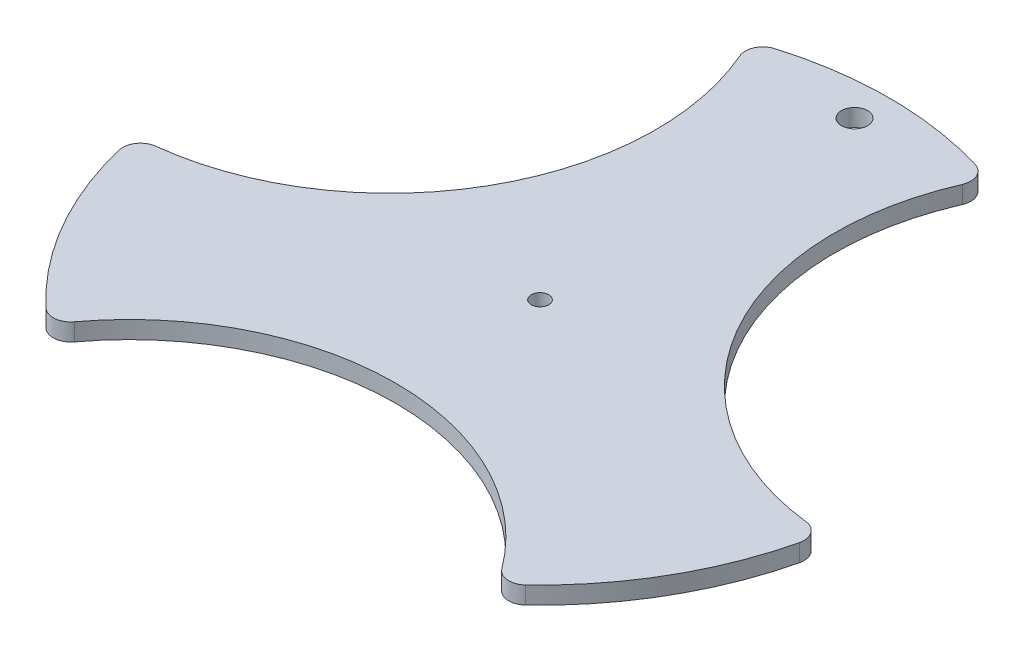
ISO-10303-21;
HEADER;
FILE_DESCRIPTION(('STEP AP214'),'2;1');
FILE_NAME('part.step','',(''),(''),'','','');
FILE_SCHEMA(('AUTOMOTIVE_DESIGN { 1 0 10303 214 1 1 1 1 }'));
ENDSEC;
DATA;
#1=APPLICATION_CONTEXT('core data for automotive mechanical design processes');
#2=APPLICATION_PROTOCOL_DEFINITION('international standard','automotive_design',2000,#1);
#3=PRODUCT_CONTEXT('',#1,'mechanical');
#4=PRODUCT('Part','Part','',(#3));
#5=PRODUCT_RELATED_PRODUCT_CATEGORY('part','',(#4));
#6=PRODUCT_DEFINITION_FORMATION('','',#4);
#7=PRODUCT_DEFINITION_CONTEXT('part definition',#1,'design');
#8=PRODUCT_DEFINITION('design','',#6,#7);
#9=PRODUCT_DEFINITION_SHAPE('','',#8);
#10=(LENGTH_UNIT() NAMED_UNIT(*) SI_UNIT(.MILLI.,.METRE.));
#11=(NAMED_UNIT(*) PLANE_ANGLE_UNIT() SI_UNIT($,.RADIAN.));
#12=(NAMED_UNIT(*) SI_UNIT($,.STERADIAN.) SOLID_ANGLE_UNIT());
#13=UNCERTAINTY_MEASURE_WITH_UNIT(LENGTH_MEASURE(1.E-05),#10,'distance_accuracy_value','');
#14=(GEOMETRIC_REPRESENTATION_CONTEXT(3) GLOBAL_UNCERTAINTY_ASSIGNED_CONTEXT((#13)) GLOBAL_UNIT_ASSIGNED_CONTEXT((#10,
#11,#12)) REPRESENTATION_CONTEXT('',''));
#15=CARTESIAN_POINT('',(0.,0.,0.));
#16=DIRECTION('',(0.,0.,1.));
#17=DIRECTION('',(1.,0.,0.));
#18=AXIS2_PLACEMENT_3D('',#15,#16,#17);
#19=CARTESIAN_POINT('',(0.,2.,0.));
#20=DIRECTION('',(0.,-1.,0.));
#21=DIRECTION('',(0.,0.,-1.));
#22=AXIS2_PLACEMENT_3D('',#19,#20,#21);
#23=CYLINDRICAL_SURFACE('',#22,40.);
#24=CARTESIAN_POINT('',(0.,2.,0.));
#25=DIRECTION('',(0.,1.,0.));
#26=DIRECTION('',(0.,0.,1.));
#27=AXIS2_PLACEMENT_3D('',#24,#25,#26);
#28=CIRCLE('',#27,40.);
#29=CARTESIAN_POINT('',(-38.9226653628251,2.,9.22096096150172));
#30=VERTEX_POINT('',#29);
#31=CARTESIAN_POINT('',(-27.4469191213783,2.,29.0975365064556));
#32=VERTEX_POINT('',#31);
#33=EDGE_CURVE('E156',#30,#32,#28,.T.);
#34=ORIENTED_EDGE('',*,*,#33,.F.);
#35=DIRECTION('',(0.,-1.,0.));
#36=VECTOR('',#35,1.);
#37=CARTESIAN_POINT('',(-38.9226653628251,2.,9.22096096150172));
#38=LINE('',#37,#36);
#39=CARTESIAN_POINT('',(-38.9226653628251,0.,9.22096096150172));
#40=VERTEX_POINT('',#39);
#41=EDGE_CURVE('E211',#30,#40,#38,.T.);
#42=ORIENTED_EDGE('',*,*,#41,.T.);
#43=CARTESIAN_POINT('',(0.,0.,0.));
#44=DIRECTION('',(0.,1.,0.));
#45=DIRECTION('',(0.,0.,1.));
#46=AXIS2_PLACEMENT_3D('',#43,#44,#45);
#47=CIRCLE('',#46,40.);
#48=CARTESIAN_POINT('',(-27.4469191213783,0.,29.0975365064556));
#49=VERTEX_POINT('',#48);
#50=EDGE_CURVE('E152',#40,#49,#47,.T.);
#51=ORIENTED_EDGE('',*,*,#50,.T.);
#52=DIRECTION('',(0.,-1.,0.));
#53=VECTOR('',#52,1.);
#54=CARTESIAN_POINT('',(-27.4469191213783,2.,29.0975365064556));
#55=LINE('',#54,#53);
#56=EDGE_CURVE('E208',#49,#32,#55,.F.);
#57=ORIENTED_EDGE('',*,*,#56,.T.);
#58=EDGE_LOOP('',(#34,#42,#51,#57));
#59=FACE_BOUND('',#58,.T.);
#60=ADVANCED_FACE('F39',(#59),#23,.T.);
#61=CARTESIAN_POINT('',(11.4757462414471,0.,-38.3184974679581));
#62=VERTEX_POINT('',#61);
#63=CARTESIAN_POINT('',(-11.4757462414463,0.,-38.3184974679583));
#64=VERTEX_POINT('',#63);
#65=EDGE_CURVE('E142',#62,#64,#47,.T.);
#66=ORIENTED_EDGE('',*,*,#65,.T.);
#67=DIRECTION('',(0.,-1.,0.));
#68=VECTOR('',#67,1.);
#69=CARTESIAN_POINT('',(-11.4757462414463,2.,-38.3184974679583));
#70=LINE('',#69,#68);
#71=CARTESIAN_POINT('',(-11.4757462414463,2.,-38.3184974679583));
#72=VERTEX_POINT('',#71);
#73=EDGE_CURVE('E146',#64,#72,#70,.F.);
#74=ORIENTED_EDGE('',*,*,#73,.T.);
#75=CARTESIAN_POINT('',(11.4757462414471,2.,-38.3184974679581));
#76=VERTEX_POINT('',#75);
#77=EDGE_CURVE('E145',#76,#72,#28,.T.);
#78=ORIENTED_EDGE('',*,*,#77,.F.);
#79=DIRECTION('',(0.,-1.,0.));
#80=VECTOR('',#79,1.);
#81=CARTESIAN_POINT('',(11.4757462414471,2.,-38.3184974679581));
#82=LINE('',#81,#80);
#83=EDGE_CURVE('E132',#76,#62,#82,.T.);
#84=ORIENTED_EDGE('',*,*,#83,.T.);
#85=EDGE_LOOP('',(#66,#74,#78,#84));
#86=FACE_BOUND('',#85,.T.);
#87=ADVANCED_FACE('F140',(#86),#23,.T.);
#88=CARTESIAN_POINT('',(27.4469191213777,2.,29.0975365064562));
#89=VERTEX_POINT('',#88);
#90=CARTESIAN_POINT('',(38.9226653628249,2.,9.22096096150251));
#91=VERTEX_POINT('',#90);
#92=EDGE_CURVE('E151',#89,#91,#28,.T.);
#93=ORIENTED_EDGE('',*,*,#92,.F.);
#94=DIRECTION('',(0.,-1.,0.));
#95=VECTOR('',#94,1.);
#96=CARTESIAN_POINT('',(27.4469191213777,2.,29.0975365064562));
#97=LINE('',#96,#95);
#98=CARTESIAN_POINT('',(27.4469191213777,0.,29.0975365064562));
#99=VERTEX_POINT('',#98);
#100=EDGE_CURVE('E11',#89,#99,#97,.T.);
#101=ORIENTED_EDGE('',*,*,#100,.T.);
#102=CARTESIAN_POINT('',(38.9226653628249,0.,9.22096096150251));
#103=VERTEX_POINT('',#102);
#104=EDGE_CURVE('E154',#99,#103,#47,.T.);
#105=ORIENTED_EDGE('',*,*,#104,.T.);
#106=DIRECTION('',(0.,-1.,0.));
#107=VECTOR('',#106,1.);
#108=CARTESIAN_POINT('',(38.9226653628249,2.,9.22096096150251));
#109=LINE('',#108,#107);
#110=EDGE_CURVE('E47',#103,#91,#109,.F.);
#111=ORIENTED_EDGE('',*,*,#110,.T.);
#112=EDGE_LOOP('',(#93,#101,#105,#111));
#113=FACE_BOUND('',#112,.T.);
#114=ADVANCED_FACE('F218',(#113),#23,.T.);
#115=CARTESIAN_POINT('',(0.,2.,0.));
#116=DIRECTION('',(0.,1.,0.));
#117=DIRECTION('',(0.,0.,1.));
#118=AXIS2_PLACEMENT_3D('',#115,#116,#117);
#119=PLANE('',#118);
#120=ORIENTED_EDGE('',*,*,#77,.T.);
#121=CARTESIAN_POINT('',(-10.901958929374,2.,-36.4025725945604));
#122=DIRECTION('',(0.,1.,0.));
#123=DIRECTION('',(0.,0.,1.));
#124=AXIS2_PLACEMENT_3D('',#121,#122,#123);
#125=CIRCLE('',#124,2.);
#126=CARTESIAN_POINT('',(-12.7372189954233,2.,-35.6077012276307));
#127=VERTEX_POINT('',#126);
#128=EDGE_CURVE('E182',#72,#127,#125,.T.);
#129=ORIENTED_EDGE('',*,*,#128,.T.);
#130=CARTESIAN_POINT('',(-40.6985714944967,2.,-23.4973312079817));
#131=DIRECTION('',(0.,1.,0.));
#132=DIRECTION('',(0.866025403784443,0.,-0.499999999999992));
#133=AXIS2_PLACEMENT_3D('',#130,#131,#132);
#134=CIRCLE('',#133,30.4712700029102);
#135=CARTESIAN_POINT('',(-37.2057833312064,2.,6.77309539021196));
#136=VERTEX_POINT('',#135);
#137=EDGE_CURVE('E241',#136,#127,#134,.T.);
#138=ORIENTED_EDGE('',*,*,#137,.F.);
#139=CARTESIAN_POINT('',(-36.9765320946838,2.,8.75991291342663));
#140=DIRECTION('',(0.,1.,0.));
#141=DIRECTION('',(0.,0.,1.));
#142=AXIS2_PLACEMENT_3D('',#139,#140,#141);
#143=CIRCLE('',#142,2.);
#144=EDGE_CURVE('E187',#136,#30,#143,.T.);
#145=ORIENTED_EDGE('',*,*,#144,.T.);
#146=ORIENTED_EDGE('',*,*,#33,.T.);
#147=CARTESIAN_POINT('',(-26.0745731653094,2.,27.6426596811328));
#148=DIRECTION('',(0.,1.,0.));
#149=DIRECTION('',(0.,0.,1.));
#150=AXIS2_PLACEMENT_3D('',#147,#148,#149);
#151=CIRCLE('',#150,2.);
#152=CARTESIAN_POINT('',(-24.4685643357827,2.,28.8346058374177));
#153=VERTEX_POINT('',#152);
#154=EDGE_CURVE('E191',#32,#153,#151,.T.);
#155=ORIENTED_EDGE('',*,*,#154,.T.);
#156=CARTESIAN_POINT('',(-4.85722573273506E-13,2.,46.9946624159623));
#157=DIRECTION('',(0.,1.,0.));
#158=DIRECTION('',(-0.866025403784436,0.,-0.500000000000004));
#159=AXIS2_PLACEMENT_3D('',#156,#157,#158);
#160=CIRCLE('',#159,30.4712700029102);
#161=CARTESIAN_POINT('',(24.4685643357822,2.,28.8346058374183));
#162=VERTEX_POINT('',#161);
#163=EDGE_CURVE('E227',#162,#153,#160,.T.);
#164=ORIENTED_EDGE('',*,*,#163,.F.);
#165=CARTESIAN_POINT('',(26.0745731653088,2.,27.6426596811334));
#166=DIRECTION('',(0.,1.,0.));
#167=DIRECTION('',(0.,0.,1.));
#168=AXIS2_PLACEMENT_3D('',#165,#166,#167);
#169=CIRCLE('',#168,2.);
#170=EDGE_CURVE('E225',#162,#89,#169,.T.);
#171=ORIENTED_EDGE('',*,*,#170,.T.);
#172=ORIENTED_EDGE('',*,*,#92,.T.);
#173=CARTESIAN_POINT('',(36.9765320946836,2.,8.75991291342739));
#174=DIRECTION('',(0.,1.,0.));
#175=DIRECTION('',(0.,0.,1.));
#176=AXIS2_PLACEMENT_3D('',#173,#174,#175);
#177=CIRCLE('',#176,2.);
#178=CARTESIAN_POINT('',(37.2057833312062,2.,6.77309539021273));
#179=VERTEX_POINT('',#178);
#180=EDGE_CURVE('E222',#91,#179,#177,.T.);
#181=ORIENTED_EDGE('',*,*,#180,.T.);
#182=CARTESIAN_POINT('',(40.6985714944972,2.,-23.4973312079809));
#183=DIRECTION('',(0.,1.,0.));
#184=DIRECTION('',(0.,0.,1.));
#185=AXIS2_PLACEMENT_3D('',#182,#183,#184);
#186=CIRCLE('',#185,30.4712700029102);
#187=CARTESIAN_POINT('',(12.737218995424,2.,-35.6077012276304));
#188=VERTEX_POINT('',#187);
#189=EDGE_CURVE('E186',#188,#179,#186,.T.);
#190=ORIENTED_EDGE('',*,*,#189,.F.);
#191=CARTESIAN_POINT('',(10.9019589293747,2.,-36.4025725945602));
#192=DIRECTION('',(0.,1.,0.));
#193=DIRECTION('',(0.,0.,1.));
#194=AXIS2_PLACEMENT_3D('',#191,#192,#193);
#195=CIRCLE('',#194,2.);
#196=EDGE_CURVE('E185',#188,#76,#195,.T.);
#197=ORIENTED_EDGE('',*,*,#196,.T.);
#198=EDGE_LOOP('',(#120,#129,#138,#145,#146,#155,#164,#171,#172,#181,#190,#197));
#199=FACE_BOUND('',#198,.T.);
#200=CARTESIAN_POINT('',(0.,2.,0.));
#201=DIRECTION('',(0.,1.,0.));
#202=DIRECTION('',(0.,0.,1.));
#203=AXIS2_PLACEMENT_3D('',#200,#201,#202);
#204=CIRCLE('',#203,1.);
#205=CARTESIAN_POINT('',(0.,2.,1.));
#206=VERTEX_POINT('',#205);
#207=EDGE_CURVE('E174',#206,#206,#204,.T.);
#208=ORIENTED_EDGE('',*,*,#207,.F.);
#209=EDGE_LOOP('',(#208));
#210=FACE_BOUND('',#209,.T.);
#211=CARTESIAN_POINT('',(0.,2.,-36.));
#212=DIRECTION('',(0.,1.,0.));
#213=DIRECTION('',(0.,0.,1.));
#214=AXIS2_PLACEMENT_3D('',#211,#212,#213);
#215=CIRCLE('',#214,1.5);
#216=CARTESIAN_POINT('',(0.,2.,-34.5));
#217=VERTEX_POINT('',#216);
#218=EDGE_CURVE('E166',#217,#217,#215,.T.);
#219=ORIENTED_EDGE('',*,*,#218,.F.);
#220=EDGE_LOOP('',(#219));
#221=FACE_BOUND('',#220,.T.);
#222=ADVANCED_FACE('F179',(#199,#210,#221),#119,.T.);
#223=CARTESIAN_POINT('',(0.,0.,0.));
#224=DIRECTION('',(0.,1.,0.));
#225=DIRECTION('',(0.,0.,1.));
#226=AXIS2_PLACEMENT_3D('',#223,#224,#225);
#227=PLANE('',#226);
#228=CARTESIAN_POINT('',(0.,0.,0.));
#229=DIRECTION('',(0.,1.,0.));
#230=DIRECTION('',(0.,0.,1.));
#231=AXIS2_PLACEMENT_3D('',#228,#229,#230);
#232=CIRCLE('',#231,1.);
#233=CARTESIAN_POINT('',(0.,0.,1.));
#234=VERTEX_POINT('',#233);
#235=EDGE_CURVE('E171',#234,#234,#232,.T.);
#236=ORIENTED_EDGE('',*,*,#235,.T.);
#237=EDGE_LOOP('',(#236));
#238=FACE_BOUND('',#237,.T.);
#239=CARTESIAN_POINT('',(0.,0.,-36.));
#240=DIRECTION('',(0.,1.,0.));
#241=DIRECTION('',(0.,0.,1.));
#242=AXIS2_PLACEMENT_3D('',#239,#240,#241);
#243=CIRCLE('',#242,1.5);
#244=CARTESIAN_POINT('',(0.,0.,-34.5));
#245=VERTEX_POINT('',#244);
#246=EDGE_CURVE('E160',#245,#245,#243,.T.);
#247=ORIENTED_EDGE('',*,*,#246,.T.);
#248=EDGE_LOOP('',(#247));
#249=FACE_BOUND('',#248,.T.);
#250=CARTESIAN_POINT('',(-40.6985714944967,0.,-23.4973312079817));
#251=DIRECTION('',(0.,1.,0.));
#252=DIRECTION('',(0.866025403784443,0.,-0.499999999999992));
#253=AXIS2_PLACEMENT_3D('',#250,#251,#252);
#254=CIRCLE('',#253,30.4712700029102);
#255=CARTESIAN_POINT('',(-37.2057833312064,0.,6.77309539021196));
#256=VERTEX_POINT('',#255);
#257=CARTESIAN_POINT('',(-12.7372189954233,0.,-35.6077012276307));
#258=VERTEX_POINT('',#257);
#259=EDGE_CURVE('E239',#256,#258,#254,.T.);
#260=ORIENTED_EDGE('',*,*,#259,.T.);
#261=CARTESIAN_POINT('',(-10.901958929374,0.,-36.4025725945604));
#262=DIRECTION('',(0.,1.,0.));
#263=DIRECTION('',(0.,0.,1.));
#264=AXIS2_PLACEMENT_3D('',#261,#262,#263);
#265=CIRCLE('',#264,2.);
#266=EDGE_CURVE('E134',#258,#64,#265,.F.);
#267=ORIENTED_EDGE('',*,*,#266,.T.);
#268=ORIENTED_EDGE('',*,*,#65,.F.);
#269=CARTESIAN_POINT('',(10.9019589293747,0.,-36.4025725945602));
#270=DIRECTION('',(0.,1.,0.));
#271=DIRECTION('',(0.,0.,1.));
#272=AXIS2_PLACEMENT_3D('',#269,#270,#271);
#273=CIRCLE('',#272,2.);
#274=CARTESIAN_POINT('',(12.737218995424,0.,-35.6077012276304));
#275=VERTEX_POINT('',#274);
#276=EDGE_CURVE('E61',#62,#275,#273,.F.);
#277=ORIENTED_EDGE('',*,*,#276,.T.);
#278=CARTESIAN_POINT('',(40.6985714944972,0.,-23.4973312079809));
#279=DIRECTION('',(0.,1.,0.));
#280=DIRECTION('',(0.,0.,1.));
#281=AXIS2_PLACEMENT_3D('',#278,#279,#280);
#282=CIRCLE('',#281,30.4712700029102);
#283=CARTESIAN_POINT('',(37.2057833312062,0.,6.77309539021273));
#284=VERTEX_POINT('',#283);
#285=EDGE_CURVE('E249',#275,#284,#282,.T.);
#286=ORIENTED_EDGE('',*,*,#285,.T.);
#287=CARTESIAN_POINT('',(36.9765320946836,0.,8.75991291342739));
#288=DIRECTION('',(0.,1.,0.));
#289=DIRECTION('',(0.,0.,1.));
#290=AXIS2_PLACEMENT_3D('',#287,#288,#289);
#291=CIRCLE('',#290,2.);
#292=EDGE_CURVE('E198',#284,#103,#291,.F.);
#293=ORIENTED_EDGE('',*,*,#292,.T.);
#294=ORIENTED_EDGE('',*,*,#104,.F.);
#295=CARTESIAN_POINT('',(26.0745731653088,0.,27.6426596811334));
#296=DIRECTION('',(0.,1.,0.));
#297=DIRECTION('',(0.,0.,1.));
#298=AXIS2_PLACEMENT_3D('',#295,#296,#297);
#299=CIRCLE('',#298,2.);
#300=CARTESIAN_POINT('',(24.4685643357822,0.,28.8346058374183));
#301=VERTEX_POINT('',#300);
#302=EDGE_CURVE('E200',#99,#301,#299,.F.);
#303=ORIENTED_EDGE('',*,*,#302,.T.);
#304=CARTESIAN_POINT('',(-4.85722573273506E-13,0.,46.9946624159623));
#305=DIRECTION('',(0.,1.,0.));
#306=DIRECTION('',(-0.866025403784436,0.,-0.500000000000004));
#307=AXIS2_PLACEMENT_3D('',#304,#305,#306);
#308=CIRCLE('',#307,30.4712700029102);
#309=CARTESIAN_POINT('',(-24.4685643357827,0.,28.8346058374177));
#310=VERTEX_POINT('',#309);
#311=EDGE_CURVE('E244',#301,#310,#308,.T.);
#312=ORIENTED_EDGE('',*,*,#311,.T.);
#313=CARTESIAN_POINT('',(-26.0745731653094,0.,27.6426596811328));
#314=DIRECTION('',(0.,1.,0.));
#315=DIRECTION('',(0.,0.,1.));
#316=AXIS2_PLACEMENT_3D('',#313,#314,#315);
#317=CIRCLE('',#316,2.);
#318=EDGE_CURVE('E202',#310,#49,#317,.F.);
#319=ORIENTED_EDGE('',*,*,#318,.T.);
#320=ORIENTED_EDGE('',*,*,#50,.F.);
#321=CARTESIAN_POINT('',(-36.9765320946838,0.,8.75991291342663));
#322=DIRECTION('',(0.,1.,0.));
#323=DIRECTION('',(0.,0.,1.));
#324=AXIS2_PLACEMENT_3D('',#321,#322,#323);
#325=CIRCLE('',#324,2.);
#326=EDGE_CURVE('E135',#40,#256,#325,.F.);
#327=ORIENTED_EDGE('',*,*,#326,.T.);
#328=EDGE_LOOP('',(#260,#267,#268,#277,#286,#293,#294,#303,#312,#319,#320,#327));
#329=FACE_BOUND('',#328,.T.);
#330=ADVANCED_FACE('F149',(#238,#249,#329),#227,.F.);
#331=CARTESIAN_POINT('',(0.,0.,-36.));
#332=DIRECTION('',(0.,1.,0.));
#333=DIRECTION('',(0.,0.,1.));
#334=AXIS2_PLACEMENT_3D('',#331,#332,#333);
#335=CYLINDRICAL_SURFACE('',#334,1.5);
#336=ORIENTED_EDGE('',*,*,#246,.F.);
#337=EDGE_LOOP('',(#336));
#338=FACE_BOUND('',#337,.T.);
#339=ORIENTED_EDGE('',*,*,#218,.T.);
#340=EDGE_LOOP('',(#339));
#341=FACE_BOUND('',#340,.T.);
#342=ADVANCED_FACE('F263',(#338,#341),#335,.F.);
#343=CARTESIAN_POINT('',(0.,0.,0.));
#344=DIRECTION('',(0.,1.,0.));
#345=DIRECTION('',(0.,0.,1.));
#346=AXIS2_PLACEMENT_3D('',#343,#344,#345);
#347=CYLINDRICAL_SURFACE('',#346,1.);
#348=ORIENTED_EDGE('',*,*,#235,.F.);
#349=EDGE_LOOP('',(#348));
#350=FACE_BOUND('',#349,.T.);
#351=ORIENTED_EDGE('',*,*,#207,.T.);
#352=EDGE_LOOP('',(#351));
#353=FACE_BOUND('',#352,.T.);
#354=ADVANCED_FACE('F257',(#350,#353),#347,.F.);
#355=CARTESIAN_POINT('',(40.6985714944972,0.,-23.4973312079809));
#356=DIRECTION('',(0.,1.,0.));
#357=DIRECTION('',(0.,0.,1.));
#358=AXIS2_PLACEMENT_3D('',#355,#356,#357);
#359=CYLINDRICAL_SURFACE('',#358,30.4712700029102);
#360=ORIENTED_EDGE('',*,*,#285,.F.);
#361=DIRECTION('',(0.,1.,0.));
#362=VECTOR('',#361,1.);
#363=CARTESIAN_POINT('',(12.737218995424,0.,-35.6077012276304));
#364=LINE('',#363,#362);
#365=EDGE_CURVE('E133',#275,#188,#364,.T.);
#366=ORIENTED_EDGE('',*,*,#365,.T.);
#367=ORIENTED_EDGE('',*,*,#189,.T.);
#368=DIRECTION('',(0.,1.,0.));
#369=VECTOR('',#368,1.);
#370=CARTESIAN_POINT('',(37.2057833312062,0.,6.77309539021273));
#371=LINE('',#370,#369);
#372=EDGE_CURVE('E54',#179,#284,#371,.F.);
#373=ORIENTED_EDGE('',*,*,#372,.T.);
#374=EDGE_LOOP('',(#360,#366,#367,#373));
#375=FACE_BOUND('',#374,.T.);
#376=ADVANCED_FACE('F271',(#375),#359,.F.);
#377=CARTESIAN_POINT('',(-40.6985714944967,0.,-23.4973312079817));
#378=DIRECTION('',(0.,1.,0.));
#379=DIRECTION('',(0.,0.,1.));
#380=AXIS2_PLACEMENT_3D('',#377,#378,#379);
#381=CYLINDRICAL_SURFACE('',#380,30.4712700029102);
#382=ORIENTED_EDGE('',*,*,#137,.T.);
#383=DIRECTION('',(0.,1.,0.));
#384=VECTOR('',#383,1.);
#385=CARTESIAN_POINT('',(-12.7372189954233,0.,-35.6077012276307));
#386=LINE('',#385,#384);
#387=EDGE_CURVE('E196',#127,#258,#386,.F.);
#388=ORIENTED_EDGE('',*,*,#387,.T.);
#389=ORIENTED_EDGE('',*,*,#259,.F.);
#390=DIRECTION('',(0.,1.,0.));
#391=VECTOR('',#390,1.);
#392=CARTESIAN_POINT('',(-37.2057833312064,0.,6.77309539021196));
#393=LINE('',#392,#391);
#394=EDGE_CURVE('E189',#256,#136,#393,.T.);
#395=ORIENTED_EDGE('',*,*,#394,.T.);
#396=EDGE_LOOP('',(#382,#388,#389,#395));
#397=FACE_BOUND('',#396,.T.);
#398=ADVANCED_FACE('F238',(#397),#381,.F.);
#399=CARTESIAN_POINT('',(-4.85722573273506E-13,0.,46.9946624159623));
#400=DIRECTION('',(0.,1.,0.));
#401=DIRECTION('',(0.,0.,1.));
#402=AXIS2_PLACEMENT_3D('',#399,#400,#401);
#403=CYLINDRICAL_SURFACE('',#402,30.4712700029102);
#404=ORIENTED_EDGE('',*,*,#163,.T.);
#405=DIRECTION('',(0.,1.,0.));
#406=VECTOR('',#405,1.);
#407=CARTESIAN_POINT('',(-24.4685643357828,0.,28.8346058374177));
#408=LINE('',#407,#406);
#409=EDGE_CURVE('E216',#153,#310,#408,.F.);
#410=ORIENTED_EDGE('',*,*,#409,.T.);
#411=ORIENTED_EDGE('',*,*,#311,.F.);
#412=DIRECTION('',(0.,1.,0.));
#413=VECTOR('',#412,1.);
#414=CARTESIAN_POINT('',(24.4685643357822,0.,28.8346058374183));
#415=LINE('',#414,#413);
#416=EDGE_CURVE('E214',#301,#162,#415,.T.);
#417=ORIENTED_EDGE('',*,*,#416,.T.);
#418=EDGE_LOOP('',(#404,#410,#411,#417));
#419=FACE_BOUND('',#418,.T.);
#420=ADVANCED_FACE('F315',(#419),#403,.F.);
#421=CARTESIAN_POINT('',(-10.901958929374,0.,-36.4025725945604));
#422=DIRECTION('',(0.,-1.,0.));
#423=DIRECTION('',(0.,0.,-1.));
#424=AXIS2_PLACEMENT_3D('',#421,#422,#423);
#425=CYLINDRICAL_SURFACE('',#424,2.);
#426=ORIENTED_EDGE('',*,*,#266,.F.);
#427=ORIENTED_EDGE('',*,*,#387,.F.);
#428=ORIENTED_EDGE('',*,*,#128,.F.);
#429=ORIENTED_EDGE('',*,*,#73,.F.);
#430=EDGE_LOOP('',(#426,#427,#428,#429));
#431=FACE_BOUND('',#430,.T.);
#432=ADVANCED_FACE('F234',(#431),#425,.T.);
#433=CARTESIAN_POINT('',(10.9019589293747,0.,-36.4025725945602));
#434=DIRECTION('',(0.,1.,0.));
#435=DIRECTION('',(0.,0.,1.));
#436=AXIS2_PLACEMENT_3D('',#433,#434,#435);
#437=CYLINDRICAL_SURFACE('',#436,2.);
#438=ORIENTED_EDGE('',*,*,#196,.F.);
#439=ORIENTED_EDGE('',*,*,#365,.F.);
#440=ORIENTED_EDGE('',*,*,#276,.F.);
#441=ORIENTED_EDGE('',*,*,#83,.F.);
#442=EDGE_LOOP('',(#438,#439,#440,#441));
#443=FACE_BOUND('',#442,.T.);
#444=ADVANCED_FACE('F131',(#443),#437,.T.);
#445=CARTESIAN_POINT('',(-36.9765320946838,0.,8.75991291342663));
#446=DIRECTION('',(0.,1.,0.));
#447=DIRECTION('',(0.,0.,1.));
#448=AXIS2_PLACEMENT_3D('',#445,#446,#447);
#449=CYLINDRICAL_SURFACE('',#448,2.);
#450=ORIENTED_EDGE('',*,*,#144,.F.);
#451=ORIENTED_EDGE('',*,*,#394,.F.);
#452=ORIENTED_EDGE('',*,*,#326,.F.);
#453=ORIENTED_EDGE('',*,*,#41,.F.);
#454=EDGE_LOOP('',(#450,#451,#452,#453));
#455=FACE_BOUND('',#454,.T.);
#456=ADVANCED_FACE('F344',(#455),#449,.T.);
#457=CARTESIAN_POINT('',(-26.0745731653094,0.,27.6426596811328));
#458=DIRECTION('',(0.,-1.,0.));
#459=DIRECTION('',(0.,0.,-1.));
#460=AXIS2_PLACEMENT_3D('',#457,#458,#459);
#461=CYLINDRICAL_SURFACE('',#460,2.);
#462=ORIENTED_EDGE('',*,*,#318,.F.);
#463=ORIENTED_EDGE('',*,*,#409,.F.);
#464=ORIENTED_EDGE('',*,*,#154,.F.);
#465=ORIENTED_EDGE('',*,*,#56,.F.);
#466=EDGE_LOOP('',(#462,#463,#464,#465));
#467=FACE_BOUND('',#466,.T.);
#468=ADVANCED_FACE('F354',(#467),#461,.T.);
#469=CARTESIAN_POINT('',(26.0745731653088,0.,27.6426596811334));
#470=DIRECTION('',(0.,1.,0.));
#471=DIRECTION('',(0.,0.,1.));
#472=AXIS2_PLACEMENT_3D('',#469,#470,#471);
#473=CYLINDRICAL_SURFACE('',#472,2.);
#474=ORIENTED_EDGE('',*,*,#170,.F.);
#475=ORIENTED_EDGE('',*,*,#416,.F.);
#476=ORIENTED_EDGE('',*,*,#302,.F.);
#477=ORIENTED_EDGE('',*,*,#100,.F.);
#478=EDGE_LOOP('',(#474,#475,#476,#477));
#479=FACE_BOUND('',#478,.T.);
#480=ADVANCED_FACE('F365',(#479),#473,.T.);
#481=CARTESIAN_POINT('',(36.9765320946836,0.,8.75991291342739));
#482=DIRECTION('',(0.,-1.,0.));
#483=DIRECTION('',(0.,0.,-1.));
#484=AXIS2_PLACEMENT_3D('',#481,#482,#483);
#485=CYLINDRICAL_SURFACE('',#484,2.);
#486=ORIENTED_EDGE('',*,*,#292,.F.);
#487=ORIENTED_EDGE('',*,*,#372,.F.);
#488=ORIENTED_EDGE('',*,*,#180,.F.);
#489=ORIENTED_EDGE('',*,*,#110,.F.);
#490=EDGE_LOOP('',(#486,#487,#488,#489));
#491=FACE_BOUND('',#490,.T.);
#492=ADVANCED_FACE('F41',(#491),#485,.T.);
#493=CLOSED_SHELL('',(#60,#87,#114,#222,#330,#342,#354,#376,#398,#420,#432,#444,#456,#468,#480,#492));
#494=MANIFOLD_SOLID_BREP('B2',#493);
#495=ADVANCED_BREP_SHAPE_REPRESENTATION('',(#18,#494),#14);
#496=SHAPE_DEFINITION_REPRESENTATION(#9,#495);
ENDSEC;
END-ISO-10303-21;
